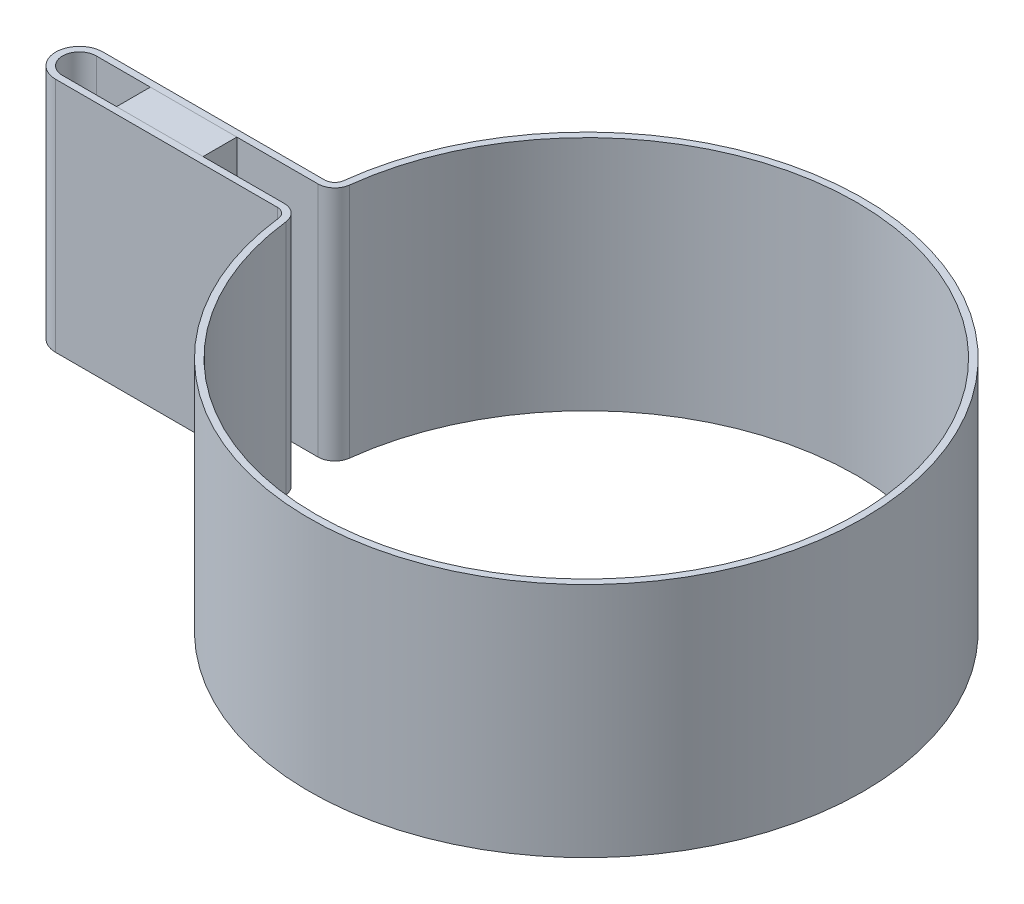
ISO-10303-21;
HEADER;
FILE_DESCRIPTION(('STEP AP214'),'2;1');
FILE_NAME('part.step','',(''),(''),'','','');
FILE_SCHEMA(('AUTOMOTIVE_DESIGN { 1 0 10303 214 1 1 1 1 }'));
ENDSEC;
DATA;
#1=APPLICATION_CONTEXT('core data for automotive mechanical design processes');
#2=APPLICATION_PROTOCOL_DEFINITION('international standard','automotive_design',2000,#1);
#3=PRODUCT_CONTEXT('',#1,'mechanical');
#4=PRODUCT('Part','Part','',(#3));
#5=PRODUCT_RELATED_PRODUCT_CATEGORY('part','',(#4));
#6=PRODUCT_DEFINITION_FORMATION('','',#4);
#7=PRODUCT_DEFINITION_CONTEXT('part definition',#1,'design');
#8=PRODUCT_DEFINITION('design','',#6,#7);
#9=PRODUCT_DEFINITION_SHAPE('','',#8);
#10=(LENGTH_UNIT() NAMED_UNIT(*) SI_UNIT(.MILLI.,.METRE.));
#11=(NAMED_UNIT(*) PLANE_ANGLE_UNIT() SI_UNIT($,.RADIAN.));
#12=(NAMED_UNIT(*) SI_UNIT($,.STERADIAN.) SOLID_ANGLE_UNIT());
#13=UNCERTAINTY_MEASURE_WITH_UNIT(LENGTH_MEASURE(1.E-05),#10,'distance_accuracy_value','');
#14=(GEOMETRIC_REPRESENTATION_CONTEXT(3) GLOBAL_UNCERTAINTY_ASSIGNED_CONTEXT((#13)) GLOBAL_UNIT_ASSIGNED_CONTEXT((#10,
#11,#12)) REPRESENTATION_CONTEXT('',''));
#15=CARTESIAN_POINT('',(0.,0.,0.));
#16=DIRECTION('',(0.,0.,1.));
#17=DIRECTION('',(1.,0.,0.));
#18=AXIS2_PLACEMENT_3D('',#15,#16,#17);
#19=CARTESIAN_POINT('',(-67.,0.,-3.49999999999998));
#20=DIRECTION('',(-1.,0.,0.));
#21=DIRECTION('',(0.,0.,1.));
#22=AXIS2_PLACEMENT_3D('',#19,#20,#21);
#23=PLANE('',#22);
#24=DIRECTION('',(0.,0.,1.));
#25=VECTOR('',#24,1.);
#26=CARTESIAN_POINT('',(-67.,35.,-3.49999999999998));
#27=LINE('',#26,#25);
#28=CARTESIAN_POINT('',(-67.,35.,-3.49999999999998));
#29=VERTEX_POINT('',#28);
#30=CARTESIAN_POINT('',(-67.,35.,3.5));
#31=VERTEX_POINT('',#30);
#32=EDGE_CURVE('E115',#29,#31,#27,.T.);
#33=ORIENTED_EDGE('',*,*,#32,.F.);
#34=DIRECTION('',(0.,1.,0.));
#35=VECTOR('',#34,1.);
#36=CARTESIAN_POINT('',(-67.,0.,-3.49999999999998));
#37=LINE('',#36,#35);
#38=CARTESIAN_POINT('',(-67.,0.,-3.49999999999998));
#39=VERTEX_POINT('',#38);
#40=EDGE_CURVE('E12',#39,#29,#37,.T.);
#41=ORIENTED_EDGE('',*,*,#40,.F.);
#42=DIRECTION('',(0.,0.,1.));
#43=VECTOR('',#42,1.);
#44=CARTESIAN_POINT('',(-67.,0.,-3.49999999999998));
#45=LINE('',#44,#43);
#46=CARTESIAN_POINT('',(-67.,0.,3.5));
#47=VERTEX_POINT('',#46);
#48=EDGE_CURVE('E109',#39,#47,#45,.T.);
#49=ORIENTED_EDGE('',*,*,#48,.T.);
#50=DIRECTION('',(0.,1.,0.));
#51=VECTOR('',#50,1.);
#52=CARTESIAN_POINT('',(-67.,0.,3.5));
#53=LINE('',#52,#51);
#54=EDGE_CURVE('E54',#47,#31,#53,.T.);
#55=ORIENTED_EDGE('',*,*,#54,.T.);
#56=EDGE_LOOP('',(#33,#41,#49,#55));
#57=FACE_BOUND('',#56,.T.);
#58=ADVANCED_FACE('F51',(#57),#23,.T.);
#59=CARTESIAN_POINT('',(-67.,0.,-3.49999999999998));
#60=DIRECTION('',(0.,0.,-1.));
#61=DIRECTION('',(-1.,0.,0.));
#62=AXIS2_PLACEMENT_3D('',#59,#60,#61);
#63=PLANE('',#62);
#64=DIRECTION('',(-1.,0.,0.));
#65=VECTOR('',#64,1.);
#66=CARTESIAN_POINT('',(-67.,35.,-3.49999999999998));
#67=LINE('',#66,#65);
#68=CARTESIAN_POINT('',(-54.2048575403353,35.,-3.49999999999998));
#69=VERTEX_POINT('',#68);
#70=EDGE_CURVE('E111',#69,#29,#67,.T.);
#71=ORIENTED_EDGE('',*,*,#70,.F.);
#72=DIRECTION('',(0.,1.,0.));
#73=VECTOR('',#72,1.);
#74=CARTESIAN_POINT('',(-54.2048575403353,0.,-3.49999999999998));
#75=LINE('',#74,#73);
#76=CARTESIAN_POINT('',(-54.2048575403353,0.,-3.49999999999998));
#77=VERTEX_POINT('',#76);
#78=EDGE_CURVE('E60',#77,#69,#75,.T.);
#79=ORIENTED_EDGE('',*,*,#78,.F.);
#80=DIRECTION('',(-1.,0.,0.));
#81=VECTOR('',#80,1.);
#82=CARTESIAN_POINT('',(-67.,0.,-3.49999999999998));
#83=LINE('',#82,#81);
#84=EDGE_CURVE('E106',#77,#39,#83,.T.);
#85=ORIENTED_EDGE('',*,*,#84,.T.);
#86=ORIENTED_EDGE('',*,*,#40,.T.);
#87=EDGE_LOOP('',(#71,#79,#85,#86));
#88=FACE_BOUND('',#87,.T.);
#89=ADVANCED_FACE('F125',(#88),#63,.T.);
#90=CARTESIAN_POINT('',(-54.2048575403353,0.,-3.49999999999998));
#91=DIRECTION('',(1.,0.,0.));
#92=DIRECTION('',(0.,0.,-1.));
#93=AXIS2_PLACEMENT_3D('',#90,#91,#92);
#94=PLANE('',#93);
#95=DIRECTION('',(0.,0.,-1.));
#96=VECTOR('',#95,1.);
#97=CARTESIAN_POINT('',(-54.2048575403353,35.,-3.49999999999998));
#98=LINE('',#97,#96);
#99=CARTESIAN_POINT('',(-54.2048575403353,35.,3.5));
#100=VERTEX_POINT('',#99);
#101=EDGE_CURVE('E101',#100,#69,#98,.T.);
#102=ORIENTED_EDGE('',*,*,#101,.F.);
#103=DIRECTION('',(0.,1.,0.));
#104=VECTOR('',#103,1.);
#105=CARTESIAN_POINT('',(-54.2048575403353,0.,3.5));
#106=LINE('',#105,#104);
#107=CARTESIAN_POINT('',(-54.2048575403353,0.,3.5));
#108=VERTEX_POINT('',#107);
#109=EDGE_CURVE('E96',#108,#100,#106,.T.);
#110=ORIENTED_EDGE('',*,*,#109,.F.);
#111=DIRECTION('',(0.,0.,-1.));
#112=VECTOR('',#111,1.);
#113=CARTESIAN_POINT('',(-54.2048575403353,0.,-3.49999999999998));
#114=LINE('',#113,#112);
#115=EDGE_CURVE('E99',#108,#77,#114,.T.);
#116=ORIENTED_EDGE('',*,*,#115,.T.);
#117=ORIENTED_EDGE('',*,*,#78,.T.);
#118=EDGE_LOOP('',(#102,#110,#116,#117));
#119=FACE_BOUND('',#118,.T.);
#120=ADVANCED_FACE('F98',(#119),#94,.T.);
#121=CARTESIAN_POINT('',(-67.,0.,3.5));
#122=DIRECTION('',(0.,0.,1.));
#123=DIRECTION('',(1.,0.,0.));
#124=AXIS2_PLACEMENT_3D('',#121,#122,#123);
#125=PLANE('',#124);
#126=DIRECTION('',(1.,0.,0.));
#127=VECTOR('',#126,1.);
#128=CARTESIAN_POINT('',(-67.,35.,3.5));
#129=LINE('',#128,#127);
#130=EDGE_CURVE('E118',#31,#100,#129,.T.);
#131=ORIENTED_EDGE('',*,*,#130,.F.);
#132=ORIENTED_EDGE('',*,*,#54,.F.);
#133=DIRECTION('',(1.,0.,0.));
#134=VECTOR('',#133,1.);
#135=CARTESIAN_POINT('',(-67.,0.,3.5));
#136=LINE('',#135,#134);
#137=EDGE_CURVE('E105',#47,#108,#136,.T.);
#138=ORIENTED_EDGE('',*,*,#137,.T.);
#139=ORIENTED_EDGE('',*,*,#109,.T.);
#140=EDGE_LOOP('',(#131,#132,#138,#139));
#141=FACE_BOUND('',#140,.T.);
#142=ADVANCED_FACE('F108',(#141),#125,.T.);
#143=CARTESIAN_POINT('',(0.,0.,0.));
#144=DIRECTION('',(0.,1.,0.));
#145=DIRECTION('',(0.,0.,1.));
#146=AXIS2_PLACEMENT_3D('',#143,#144,#145);
#147=PLANE('',#146);
#148=ORIENTED_EDGE('',*,*,#48,.F.);
#149=ORIENTED_EDGE('',*,*,#84,.F.);
#150=ORIENTED_EDGE('',*,*,#115,.F.);
#151=ORIENTED_EDGE('',*,*,#137,.F.);
#152=EDGE_LOOP('',(#148,#149,#150,#151));
#153=FACE_BOUND('',#152,.T.);
#154=ADVANCED_FACE('F104',(#153),#147,.F.);
#155=CARTESIAN_POINT('',(0.,35.,0.));
#156=DIRECTION('',(0.,1.,0.));
#157=DIRECTION('',(0.,0.,1.));
#158=AXIS2_PLACEMENT_3D('',#155,#156,#157);
#159=PLANE('',#158);
#160=ORIENTED_EDGE('',*,*,#32,.T.);
#161=ORIENTED_EDGE('',*,*,#130,.T.);
#162=ORIENTED_EDGE('',*,*,#101,.T.);
#163=ORIENTED_EDGE('',*,*,#70,.T.);
#164=EDGE_LOOP('',(#160,#161,#162,#163));
#165=FACE_BOUND('',#164,.T.);
#166=ADVANCED_FACE('F124',(#165),#159,.T.);
#167=CLOSED_SHELL('',(#58,#89,#120,#142,#154,#166));
#168=MANIFOLD_SOLID_BREP('B2',#167);
#169=CARTESIAN_POINT('',(-75.,35.,0.));
#170=DIRECTION('',(0.,1.,0.));
#171=DIRECTION('',(0.,0.,1.));
#172=AXIS2_PLACEMENT_3D('',#169,#170,#171);
#173=PLANE('',#172);
#174=CARTESIAN_POINT('',(-75.,35.,0.));
#175=DIRECTION('',(0.,1.,0.));
#176=DIRECTION('',(0.,0.,1.));
#177=AXIS2_PLACEMENT_3D('',#174,#175,#176);
#178=CIRCLE('',#177,3.49999999999999);
#179=CARTESIAN_POINT('',(-75.,35.,-3.49999999999998));
#180=VERTEX_POINT('',#179);
#181=CARTESIAN_POINT('',(-75.,35.,3.5));
#182=VERTEX_POINT('',#181);
#183=EDGE_CURVE('E315',#180,#182,#178,.T.);
#184=ORIENTED_EDGE('',*,*,#183,.T.);
#185=DIRECTION('',(1.,0.,0.));
#186=VECTOR('',#185,1.);
#187=CARTESIAN_POINT('',(-75.,35.,3.5));
#188=LINE('',#187,#186);
#189=CARTESIAN_POINT('',(-42.2048575403353,35.,3.49999999999998));
#190=VERTEX_POINT('',#189);
#191=EDGE_CURVE('E318',#182,#190,#188,.T.);
#192=ORIENTED_EDGE('',*,*,#191,.T.);
#193=CARTESIAN_POINT('',(-42.2048575403353,35.,4.99999999999998));
#194=DIRECTION('',(0.,-1.,0.));
#195=DIRECTION('',(0.,0.,1.));
#196=AXIS2_PLACEMENT_3D('',#193,#194,#195);
#197=CIRCLE('',#196,1.5);
#198=CARTESIAN_POINT('',(-40.7152743330294,35.,4.82352941176466));
#199=VERTEX_POINT('',#198);
#200=EDGE_CURVE('E321',#190,#199,#197,.T.);
#201=ORIENTED_EDGE('',*,*,#200,.T.);
#202=CARTESIAN_POINT('',(0.,35.,0.));
#203=DIRECTION('',(0.,1.,0.));
#204=DIRECTION('',(0.,0.,1.));
#205=AXIS2_PLACEMENT_3D('',#202,#203,#204);
#206=CIRCLE('',#205,41.);
#207=CARTESIAN_POINT('',(-40.7152743330294,35.,-4.82352941176471));
#208=VERTEX_POINT('',#207);
#209=EDGE_CURVE('E323',#199,#208,#206,.T.);
#210=ORIENTED_EDGE('',*,*,#209,.T.);
#211=CARTESIAN_POINT('',(-42.2048575403353,35.,-5.));
#212=DIRECTION('',(0.,-1.,0.));
#213=DIRECTION('',(0.,0.,1.));
#214=AXIS2_PLACEMENT_3D('',#211,#212,#213);
#215=CIRCLE('',#214,1.50000000000001);
#216=CARTESIAN_POINT('',(-42.2048575403353,35.,-3.49999999999998));
#217=VERTEX_POINT('',#216);
#218=EDGE_CURVE('E325',#208,#217,#215,.T.);
#219=ORIENTED_EDGE('',*,*,#218,.T.);
#220=DIRECTION('',(-1.,0.,0.));
#221=VECTOR('',#220,1.);
#222=CARTESIAN_POINT('',(-75.,35.,-3.49999999999998));
#223=LINE('',#222,#221);
#224=EDGE_CURVE('E327',#217,#180,#223,.T.);
#225=ORIENTED_EDGE('',*,*,#224,.T.);
#226=EDGE_LOOP('',(#184,#192,#201,#210,#219,#225));
#227=FACE_BOUND('',#226,.T.);
#228=CARTESIAN_POINT('',(0.,35.,0.));
#229=DIRECTION('',(0.,1.,0.));
#230=DIRECTION('',(0.,0.,1.));
#231=AXIS2_PLACEMENT_3D('',#228,#229,#230);
#232=CIRCLE('',#231,40.);
#233=CARTESIAN_POINT('',(-39.7222188614921,35.,4.70588235294116));
#234=VERTEX_POINT('',#233);
#235=CARTESIAN_POINT('',(-39.7222188614921,35.,-4.70588235294118));
#236=VERTEX_POINT('',#235);
#237=EDGE_CURVE('E272',#234,#236,#232,.T.);
#238=ORIENTED_EDGE('',*,*,#237,.F.);
#239=CARTESIAN_POINT('',(-42.2048575403353,35.,4.99999999999998));
#240=DIRECTION('',(0.,-1.,0.));
#241=DIRECTION('',(0.,0.,1.));
#242=AXIS2_PLACEMENT_3D('',#239,#240,#241);
#243=CIRCLE('',#242,2.49999999999999);
#244=CARTESIAN_POINT('',(-42.2048575403353,35.,2.5));
#245=VERTEX_POINT('',#244);
#246=EDGE_CURVE('E264',#245,#234,#243,.T.);
#247=ORIENTED_EDGE('',*,*,#246,.F.);
#248=DIRECTION('',(1.,0.,0.));
#249=VECTOR('',#248,1.);
#250=CARTESIAN_POINT('',(-75.,35.,2.5));
#251=LINE('',#250,#249);
#252=CARTESIAN_POINT('',(-75.,35.,2.5));
#253=VERTEX_POINT('',#252);
#254=EDGE_CURVE('E293',#253,#245,#251,.T.);
#255=ORIENTED_EDGE('',*,*,#254,.F.);
#256=CARTESIAN_POINT('',(-75.,35.,0.));
#257=DIRECTION('',(0.,1.,0.));
#258=DIRECTION('',(0.,0.,1.));
#259=AXIS2_PLACEMENT_3D('',#256,#257,#258);
#260=CIRCLE('',#259,2.49999999999999);
#261=CARTESIAN_POINT('',(-75.,35.,-2.49999999999998));
#262=VERTEX_POINT('',#261);
#263=EDGE_CURVE('E291',#262,#253,#260,.T.);
#264=ORIENTED_EDGE('',*,*,#263,.F.);
#265=DIRECTION('',(-1.,0.,0.));
#266=VECTOR('',#265,1.);
#267=CARTESIAN_POINT('',(-75.,35.,-2.49999999999998));
#268=LINE('',#267,#266);
#269=CARTESIAN_POINT('',(-42.2048575403353,35.,-2.5));
#270=VERTEX_POINT('',#269);
#271=EDGE_CURVE('E287',#270,#262,#268,.T.);
#272=ORIENTED_EDGE('',*,*,#271,.F.);
#273=CARTESIAN_POINT('',(-42.2048575403353,35.,-5.));
#274=DIRECTION('',(0.,-1.,0.));
#275=DIRECTION('',(0.,0.,1.));
#276=AXIS2_PLACEMENT_3D('',#273,#274,#275);
#277=CIRCLE('',#276,2.5);
#278=EDGE_CURVE('E285',#236,#270,#277,.T.);
#279=ORIENTED_EDGE('',*,*,#278,.F.);
#280=EDGE_LOOP('',(#238,#247,#255,#264,#272,#279));
#281=FACE_BOUND('',#280,.T.);
#282=ADVANCED_FACE('F175',(#227,#281),#173,.T.);
#283=CARTESIAN_POINT('',(-75.,0.,0.));
#284=DIRECTION('',(0.,1.,0.));
#285=DIRECTION('',(0.,0.,1.));
#286=AXIS2_PLACEMENT_3D('',#283,#284,#285);
#287=PLANE('',#286);
#288=CARTESIAN_POINT('',(-75.,0.,0.));
#289=DIRECTION('',(0.,1.,0.));
#290=DIRECTION('',(0.,0.,1.));
#291=AXIS2_PLACEMENT_3D('',#288,#289,#290);
#292=CIRCLE('',#291,3.49999999999999);
#293=CARTESIAN_POINT('',(-75.,0.,-3.49999999999998));
#294=VERTEX_POINT('',#293);
#295=CARTESIAN_POINT('',(-75.,0.,3.5));
#296=VERTEX_POINT('',#295);
#297=EDGE_CURVE('E280',#294,#296,#292,.T.);
#298=ORIENTED_EDGE('',*,*,#297,.F.);
#299=DIRECTION('',(-1.,0.,0.));
#300=VECTOR('',#299,1.);
#301=CARTESIAN_POINT('',(-75.,0.,-3.49999999999998));
#302=LINE('',#301,#300);
#303=CARTESIAN_POINT('',(-42.2048575403353,0.,-3.49999999999998));
#304=VERTEX_POINT('',#303);
#305=EDGE_CURVE('E319',#304,#294,#302,.T.);
#306=ORIENTED_EDGE('',*,*,#305,.F.);
#307=CARTESIAN_POINT('',(-42.2048575403353,0.,-5.));
#308=DIRECTION('',(0.,-1.,0.));
#309=DIRECTION('',(0.,0.,1.));
#310=AXIS2_PLACEMENT_3D('',#307,#308,#309);
#311=CIRCLE('',#310,1.50000000000001);
#312=CARTESIAN_POINT('',(-40.7152743330294,0.,-4.82352941176471));
#313=VERTEX_POINT('',#312);
#314=EDGE_CURVE('E338',#313,#304,#311,.T.);
#315=ORIENTED_EDGE('',*,*,#314,.F.);
#316=CARTESIAN_POINT('',(0.,0.,0.));
#317=DIRECTION('',(0.,1.,0.));
#318=DIRECTION('',(0.,0.,1.));
#319=AXIS2_PLACEMENT_3D('',#316,#317,#318);
#320=CIRCLE('',#319,41.);
#321=CARTESIAN_POINT('',(-40.7152743330294,0.,4.82352941176466));
#322=VERTEX_POINT('',#321);
#323=EDGE_CURVE('E336',#322,#313,#320,.T.);
#324=ORIENTED_EDGE('',*,*,#323,.F.);
#325=CARTESIAN_POINT('',(-42.2048575403353,0.,4.99999999999998));
#326=DIRECTION('',(0.,-1.,0.));
#327=DIRECTION('',(0.,0.,1.));
#328=AXIS2_PLACEMENT_3D('',#325,#326,#327);
#329=CIRCLE('',#328,1.5);
#330=CARTESIAN_POINT('',(-42.2048575403353,0.,3.49999999999998));
#331=VERTEX_POINT('',#330);
#332=EDGE_CURVE('E334',#331,#322,#329,.T.);
#333=ORIENTED_EDGE('',*,*,#332,.F.);
#334=DIRECTION('',(1.,0.,0.));
#335=VECTOR('',#334,1.);
#336=CARTESIAN_POINT('',(-75.,0.,3.5));
#337=LINE('',#336,#335);
#338=EDGE_CURVE('E332',#296,#331,#337,.T.);
#339=ORIENTED_EDGE('',*,*,#338,.F.);
#340=EDGE_LOOP('',(#298,#306,#315,#324,#333,#339));
#341=FACE_BOUND('',#340,.T.);
#342=CARTESIAN_POINT('',(-42.2048575403353,0.,4.99999999999998));
#343=DIRECTION('',(0.,-1.,0.));
#344=DIRECTION('',(0.,0.,1.));
#345=AXIS2_PLACEMENT_3D('',#342,#343,#344);
#346=CIRCLE('',#345,2.49999999999999);
#347=CARTESIAN_POINT('',(-42.2048575403353,0.,2.5));
#348=VERTEX_POINT('',#347);
#349=CARTESIAN_POINT('',(-39.7222188614921,0.,4.70588235294116));
#350=VERTEX_POINT('',#349);
#351=EDGE_CURVE('E198',#348,#350,#346,.T.);
#352=ORIENTED_EDGE('',*,*,#351,.T.);
#353=CARTESIAN_POINT('',(0.,0.,0.));
#354=DIRECTION('',(0.,1.,0.));
#355=DIRECTION('',(0.,0.,1.));
#356=AXIS2_PLACEMENT_3D('',#353,#354,#355);
#357=CIRCLE('',#356,40.);
#358=CARTESIAN_POINT('',(-39.7222188614921,0.,-4.70588235294118));
#359=VERTEX_POINT('',#358);
#360=EDGE_CURVE('E279',#350,#359,#357,.T.);
#361=ORIENTED_EDGE('',*,*,#360,.T.);
#362=CARTESIAN_POINT('',(-42.2048575403353,0.,-5.));
#363=DIRECTION('',(0.,-1.,0.));
#364=DIRECTION('',(0.,0.,1.));
#365=AXIS2_PLACEMENT_3D('',#362,#363,#364);
#366=CIRCLE('',#365,2.5);
#367=CARTESIAN_POINT('',(-42.2048575403353,0.,-2.5));
#368=VERTEX_POINT('',#367);
#369=EDGE_CURVE('E297',#359,#368,#366,.T.);
#370=ORIENTED_EDGE('',*,*,#369,.T.);
#371=DIRECTION('',(-1.,0.,0.));
#372=VECTOR('',#371,1.);
#373=CARTESIAN_POINT('',(-75.,0.,-2.49999999999998));
#374=LINE('',#373,#372);
#375=CARTESIAN_POINT('',(-75.,0.,-2.49999999999998));
#376=VERTEX_POINT('',#375);
#377=EDGE_CURVE('E300',#368,#376,#374,.T.);
#378=ORIENTED_EDGE('',*,*,#377,.T.);
#379=CARTESIAN_POINT('',(-75.,0.,0.));
#380=DIRECTION('',(0.,1.,0.));
#381=DIRECTION('',(0.,0.,1.));
#382=AXIS2_PLACEMENT_3D('',#379,#380,#381);
#383=CIRCLE('',#382,2.49999999999999);
#384=CARTESIAN_POINT('',(-75.,0.,2.5));
#385=VERTEX_POINT('',#384);
#386=EDGE_CURVE('E303',#376,#385,#383,.T.);
#387=ORIENTED_EDGE('',*,*,#386,.T.);
#388=DIRECTION('',(1.,0.,0.));
#389=VECTOR('',#388,1.);
#390=CARTESIAN_POINT('',(-75.,0.,2.5));
#391=LINE('',#390,#389);
#392=EDGE_CURVE('E273',#385,#348,#391,.T.);
#393=ORIENTED_EDGE('',*,*,#392,.T.);
#394=EDGE_LOOP('',(#352,#361,#370,#378,#387,#393));
#395=FACE_BOUND('',#394,.T.);
#396=ADVANCED_FACE('F362',(#341,#395),#287,.F.);
#397=CARTESIAN_POINT('',(-75.,35.,0.));
#398=DIRECTION('',(0.,-1.,0.));
#399=DIRECTION('',(0.,0.,-1.));
#400=AXIS2_PLACEMENT_3D('',#397,#398,#399);
#401=CYLINDRICAL_SURFACE('',#400,3.49999999999999);
#402=ORIENTED_EDGE('',*,*,#297,.T.);
#403=DIRECTION('',(0.,-1.,0.));
#404=VECTOR('',#403,1.);
#405=CARTESIAN_POINT('',(-75.,35.,3.5));
#406=LINE('',#405,#404);
#407=EDGE_CURVE('E49',#182,#296,#406,.T.);
#408=ORIENTED_EDGE('',*,*,#407,.F.);
#409=ORIENTED_EDGE('',*,*,#183,.F.);
#410=DIRECTION('',(0.,-1.,0.));
#411=VECTOR('',#410,1.);
#412=CARTESIAN_POINT('',(-75.,35.,-3.49999999999998));
#413=LINE('',#412,#411);
#414=EDGE_CURVE('E329',#180,#294,#413,.T.);
#415=ORIENTED_EDGE('',*,*,#414,.T.);
#416=EDGE_LOOP('',(#402,#408,#409,#415));
#417=FACE_BOUND('',#416,.T.);
#418=ADVANCED_FACE('F177',(#417),#401,.T.);
#419=CARTESIAN_POINT('',(-75.,35.,3.5));
#420=DIRECTION('',(0.,0.,-1.));
#421=DIRECTION('',(-1.,0.,0.));
#422=AXIS2_PLACEMENT_3D('',#419,#420,#421);
#423=PLANE('',#422);
#424=ORIENTED_EDGE('',*,*,#338,.T.);
#425=DIRECTION('',(0.,-1.,0.));
#426=VECTOR('',#425,1.);
#427=CARTESIAN_POINT('',(-42.2048575403353,35.,3.49999999999998));
#428=LINE('',#427,#426);
#429=EDGE_CURVE('E183',#190,#331,#428,.T.);
#430=ORIENTED_EDGE('',*,*,#429,.F.);
#431=ORIENTED_EDGE('',*,*,#191,.F.);
#432=ORIENTED_EDGE('',*,*,#407,.T.);
#433=EDGE_LOOP('',(#424,#430,#431,#432));
#434=FACE_BOUND('',#433,.T.);
#435=ADVANCED_FACE('F379',(#434),#423,.F.);
#436=CARTESIAN_POINT('',(-42.2048575403353,35.,4.99999999999998));
#437=DIRECTION('',(0.,-1.,0.));
#438=DIRECTION('',(0.,0.,-1.));
#439=AXIS2_PLACEMENT_3D('',#436,#437,#438);
#440=CYLINDRICAL_SURFACE('',#439,1.5);
#441=ORIENTED_EDGE('',*,*,#332,.T.);
#442=DIRECTION('',(0.,-1.,0.));
#443=VECTOR('',#442,1.);
#444=CARTESIAN_POINT('',(-40.7152743330294,35.,4.82352941176466));
#445=LINE('',#444,#443);
#446=EDGE_CURVE('E349',#199,#322,#445,.T.);
#447=ORIENTED_EDGE('',*,*,#446,.F.);
#448=ORIENTED_EDGE('',*,*,#200,.F.);
#449=ORIENTED_EDGE('',*,*,#429,.T.);
#450=EDGE_LOOP('',(#441,#447,#448,#449));
#451=FACE_BOUND('',#450,.T.);
#452=ADVANCED_FACE('F356',(#451),#440,.F.);
#453=CARTESIAN_POINT('',(0.,35.,0.));
#454=DIRECTION('',(0.,-1.,0.));
#455=DIRECTION('',(0.,0.,-1.));
#456=AXIS2_PLACEMENT_3D('',#453,#454,#455);
#457=CYLINDRICAL_SURFACE('',#456,41.);
#458=ORIENTED_EDGE('',*,*,#323,.T.);
#459=DIRECTION('',(0.,-1.,0.));
#460=VECTOR('',#459,1.);
#461=CARTESIAN_POINT('',(-40.7152743330294,35.,-4.82352941176471));
#462=LINE('',#461,#460);
#463=EDGE_CURVE('E346',#208,#313,#462,.T.);
#464=ORIENTED_EDGE('',*,*,#463,.F.);
#465=ORIENTED_EDGE('',*,*,#209,.F.);
#466=ORIENTED_EDGE('',*,*,#446,.T.);
#467=EDGE_LOOP('',(#458,#464,#465,#466));
#468=FACE_BOUND('',#467,.T.);
#469=ADVANCED_FACE('F368',(#468),#457,.T.);
#470=CARTESIAN_POINT('',(-42.2048575403353,35.,-5.));
#471=DIRECTION('',(0.,-1.,0.));
#472=DIRECTION('',(0.,0.,-1.));
#473=AXIS2_PLACEMENT_3D('',#470,#471,#472);
#474=CYLINDRICAL_SURFACE('',#473,1.50000000000001);
#475=ORIENTED_EDGE('',*,*,#314,.T.);
#476=DIRECTION('',(0.,-1.,0.));
#477=VECTOR('',#476,1.);
#478=CARTESIAN_POINT('',(-42.2048575403353,35.,-3.49999999999998));
#479=LINE('',#478,#477);
#480=EDGE_CURVE('E343',#217,#304,#479,.T.);
#481=ORIENTED_EDGE('',*,*,#480,.F.);
#482=ORIENTED_EDGE('',*,*,#218,.F.);
#483=ORIENTED_EDGE('',*,*,#463,.T.);
#484=EDGE_LOOP('',(#475,#481,#482,#483));
#485=FACE_BOUND('',#484,.T.);
#486=ADVANCED_FACE('F372',(#485),#474,.F.);
#487=CARTESIAN_POINT('',(-75.,35.,-3.49999999999998));
#488=DIRECTION('',(0.,0.,1.));
#489=DIRECTION('',(1.,0.,0.));
#490=AXIS2_PLACEMENT_3D('',#487,#488,#489);
#491=PLANE('',#490);
#492=ORIENTED_EDGE('',*,*,#305,.T.);
#493=ORIENTED_EDGE('',*,*,#414,.F.);
#494=ORIENTED_EDGE('',*,*,#224,.F.);
#495=ORIENTED_EDGE('',*,*,#480,.T.);
#496=EDGE_LOOP('',(#492,#493,#494,#495));
#497=FACE_BOUND('',#496,.T.);
#498=ADVANCED_FACE('F382',(#497),#491,.F.);
#499=CARTESIAN_POINT('',(-42.2048575403353,35.,4.99999999999998));
#500=DIRECTION('',(0.,-1.,0.));
#501=DIRECTION('',(0.,0.,-1.));
#502=AXIS2_PLACEMENT_3D('',#499,#500,#501);
#503=CYLINDRICAL_SURFACE('',#502,2.49999999999999);
#504=ORIENTED_EDGE('',*,*,#351,.F.);
#505=DIRECTION('',(0.,-1.,0.));
#506=VECTOR('',#505,1.);
#507=CARTESIAN_POINT('',(-42.2048575403353,35.,2.5));
#508=LINE('',#507,#506);
#509=EDGE_CURVE('E268',#245,#348,#508,.T.);
#510=ORIENTED_EDGE('',*,*,#509,.F.);
#511=ORIENTED_EDGE('',*,*,#246,.T.);
#512=DIRECTION('',(0.,-1.,0.));
#513=VECTOR('',#512,1.);
#514=CARTESIAN_POINT('',(-39.7222188614921,35.,4.70588235294116));
#515=LINE('',#514,#513);
#516=EDGE_CURVE('E267',#234,#350,#515,.T.);
#517=ORIENTED_EDGE('',*,*,#516,.T.);
#518=EDGE_LOOP('',(#504,#510,#511,#517));
#519=FACE_BOUND('',#518,.T.);
#520=ADVANCED_FACE('F266',(#519),#503,.T.);
#521=CARTESIAN_POINT('',(0.,35.,0.));
#522=DIRECTION('',(0.,-1.,0.));
#523=DIRECTION('',(0.,0.,-1.));
#524=AXIS2_PLACEMENT_3D('',#521,#522,#523);
#525=CYLINDRICAL_SURFACE('',#524,40.);
#526=ORIENTED_EDGE('',*,*,#360,.F.);
#527=ORIENTED_EDGE('',*,*,#516,.F.);
#528=ORIENTED_EDGE('',*,*,#237,.T.);
#529=DIRECTION('',(0.,-1.,0.));
#530=VECTOR('',#529,1.);
#531=CARTESIAN_POINT('',(-39.7222188614921,35.,-4.70588235294118));
#532=LINE('',#531,#530);
#533=EDGE_CURVE('E281',#236,#359,#532,.T.);
#534=ORIENTED_EDGE('',*,*,#533,.T.);
#535=EDGE_LOOP('',(#526,#527,#528,#534));
#536=FACE_BOUND('',#535,.T.);
#537=ADVANCED_FACE('F276',(#536),#525,.F.);
#538=CARTESIAN_POINT('',(-42.2048575403353,35.,-5.));
#539=DIRECTION('',(0.,-1.,0.));
#540=DIRECTION('',(0.,0.,-1.));
#541=AXIS2_PLACEMENT_3D('',#538,#539,#540);
#542=CYLINDRICAL_SURFACE('',#541,2.5);
#543=ORIENTED_EDGE('',*,*,#369,.F.);
#544=ORIENTED_EDGE('',*,*,#533,.F.);
#545=ORIENTED_EDGE('',*,*,#278,.T.);
#546=DIRECTION('',(0.,-1.,0.));
#547=VECTOR('',#546,1.);
#548=CARTESIAN_POINT('',(-42.2048575403353,35.,-2.5));
#549=LINE('',#548,#547);
#550=EDGE_CURVE('E312',#270,#368,#549,.T.);
#551=ORIENTED_EDGE('',*,*,#550,.T.);
#552=EDGE_LOOP('',(#543,#544,#545,#551));
#553=FACE_BOUND('',#552,.T.);
#554=ADVANCED_FACE('F400',(#553),#542,.T.);
#555=CARTESIAN_POINT('',(-75.,35.,-2.49999999999998));
#556=DIRECTION('',(0.,0.,1.));
#557=DIRECTION('',(1.,0.,0.));
#558=AXIS2_PLACEMENT_3D('',#555,#556,#557);
#559=PLANE('',#558);
#560=ORIENTED_EDGE('',*,*,#377,.F.);
#561=ORIENTED_EDGE('',*,*,#550,.F.);
#562=ORIENTED_EDGE('',*,*,#271,.T.);
#563=DIRECTION('',(0.,-1.,0.));
#564=VECTOR('',#563,1.);
#565=CARTESIAN_POINT('',(-75.,35.,-2.49999999999998));
#566=LINE('',#565,#564);
#567=EDGE_CURVE('E310',#262,#376,#566,.T.);
#568=ORIENTED_EDGE('',*,*,#567,.T.);
#569=EDGE_LOOP('',(#560,#561,#562,#568));
#570=FACE_BOUND('',#569,.T.);
#571=ADVANCED_FACE('F403',(#570),#559,.T.);
#572=CARTESIAN_POINT('',(-75.,35.,0.));
#573=DIRECTION('',(0.,-1.,0.));
#574=DIRECTION('',(0.,0.,-1.));
#575=AXIS2_PLACEMENT_3D('',#572,#573,#574);
#576=CYLINDRICAL_SURFACE('',#575,2.49999999999999);
#577=ORIENTED_EDGE('',*,*,#386,.F.);
#578=ORIENTED_EDGE('',*,*,#567,.F.);
#579=ORIENTED_EDGE('',*,*,#263,.T.);
#580=DIRECTION('',(0.,-1.,0.));
#581=VECTOR('',#580,1.);
#582=CARTESIAN_POINT('',(-75.,35.,2.5));
#583=LINE('',#582,#581);
#584=EDGE_CURVE('E190',#253,#385,#583,.T.);
#585=ORIENTED_EDGE('',*,*,#584,.T.);
#586=EDGE_LOOP('',(#577,#578,#579,#585));
#587=FACE_BOUND('',#586,.T.);
#588=ADVANCED_FACE('F407',(#587),#576,.F.);
#589=CARTESIAN_POINT('',(-75.,35.,2.5));
#590=DIRECTION('',(0.,0.,-1.));
#591=DIRECTION('',(-1.,0.,0.));
#592=AXIS2_PLACEMENT_3D('',#589,#590,#591);
#593=PLANE('',#592);
#594=ORIENTED_EDGE('',*,*,#392,.F.);
#595=ORIENTED_EDGE('',*,*,#584,.F.);
#596=ORIENTED_EDGE('',*,*,#254,.T.);
#597=ORIENTED_EDGE('',*,*,#509,.T.);
#598=EDGE_LOOP('',(#594,#595,#596,#597));
#599=FACE_BOUND('',#598,.T.);
#600=ADVANCED_FACE('F411',(#599),#593,.T.);
#601=CLOSED_SHELL('',(#282,#396,#418,#435,#452,#469,#486,#498,#520,#537,#554,#571,#588,#600));
#602=MANIFOLD_SOLID_BREP('B6',#601);
#603=ADVANCED_BREP_SHAPE_REPRESENTATION('',(#18,#168,#602),#14);
#604=SHAPE_DEFINITION_REPRESENTATION(#9,#603);
ENDSEC;
END-ISO-10303-21;
